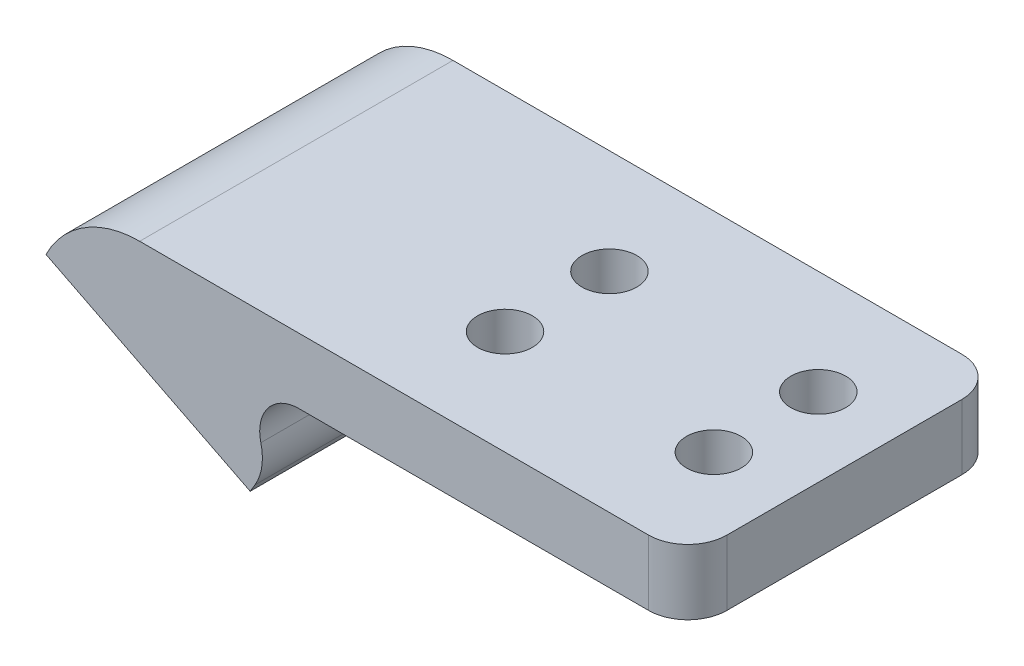
ISO-10303-21;
HEADER;
FILE_DESCRIPTION(('STEP AP214'),'2;1');
FILE_NAME('part.step','',(''),(''),'','','');
FILE_SCHEMA(('AUTOMOTIVE_DESIGN { 1 0 10303 214 1 1 1 1 }'));
ENDSEC;
DATA;
#1=APPLICATION_CONTEXT('core data for automotive mechanical design processes');
#2=APPLICATION_PROTOCOL_DEFINITION('international standard','automotive_design',2000,#1);
#3=PRODUCT_CONTEXT('',#1,'mechanical');
#4=PRODUCT('Part','Part','',(#3));
#5=PRODUCT_RELATED_PRODUCT_CATEGORY('part','',(#4));
#6=PRODUCT_DEFINITION_FORMATION('','',#4);
#7=PRODUCT_DEFINITION_CONTEXT('part definition',#1,'design');
#8=PRODUCT_DEFINITION('design','',#6,#7);
#9=PRODUCT_DEFINITION_SHAPE('','',#8);
#10=(LENGTH_UNIT() NAMED_UNIT(*) SI_UNIT(.MILLI.,.METRE.));
#11=(NAMED_UNIT(*) PLANE_ANGLE_UNIT() SI_UNIT($,.RADIAN.));
#12=(NAMED_UNIT(*) SI_UNIT($,.STERADIAN.) SOLID_ANGLE_UNIT());
#13=UNCERTAINTY_MEASURE_WITH_UNIT(LENGTH_MEASURE(1.E-05),#10,'distance_accuracy_value','');
#14=(GEOMETRIC_REPRESENTATION_CONTEXT(3) GLOBAL_UNCERTAINTY_ASSIGNED_CONTEXT((#13)) GLOBAL_UNIT_ASSIGNED_CONTEXT((#10,
#11,#12)) REPRESENTATION_CONTEXT('',''));
#15=CARTESIAN_POINT('',(0.,0.,0.));
#16=DIRECTION('',(0.,0.,1.));
#17=DIRECTION('',(1.,0.,0.));
#18=AXIS2_PLACEMENT_3D('',#15,#16,#17);
#19=CARTESIAN_POINT('',(-6.55963087060098,0.,24.));
#20=DIRECTION('',(0.,1.,0.));
#21=DIRECTION('',(0.,0.,1.));
#22=AXIS2_PLACEMENT_3D('',#19,#20,#21);
#23=PLANE('',#22);
#24=CARTESIAN_POINT('',(8.44036912939902,0.,8.));
#25=DIRECTION('',(0.,1.,0.));
#26=DIRECTION('',(0.,0.,1.));
#27=AXIS2_PLACEMENT_3D('',#24,#25,#26);
#28=CIRCLE('',#27,2.1);
#29=CARTESIAN_POINT('',(8.44036912939902,0.,10.1));
#30=VERTEX_POINT('',#29);
#31=EDGE_CURVE('E463',#30,#30,#28,.T.);
#32=ORIENTED_EDGE('',*,*,#31,.T.);
#33=EDGE_LOOP('',(#32));
#34=FACE_BOUND('',#33,.T.);
#35=CARTESIAN_POINT('',(24.440369129399,0.,16.));
#36=DIRECTION('',(0.,1.,0.));
#37=DIRECTION('',(0.,0.,1.));
#38=AXIS2_PLACEMENT_3D('',#35,#36,#37);
#39=CIRCLE('',#38,2.1);
#40=CARTESIAN_POINT('',(24.440369129399,0.,18.1));
#41=VERTEX_POINT('',#40);
#42=EDGE_CURVE('E468',#41,#41,#39,.T.);
#43=ORIENTED_EDGE('',*,*,#42,.T.);
#44=EDGE_LOOP('',(#43));
#45=FACE_BOUND('',#44,.T.);
#46=CARTESIAN_POINT('',(24.440369129399,0.,8.));
#47=DIRECTION('',(0.,1.,0.));
#48=DIRECTION('',(0.,0.,1.));
#49=AXIS2_PLACEMENT_3D('',#46,#47,#48);
#50=CIRCLE('',#49,2.1);
#51=CARTESIAN_POINT('',(24.440369129399,0.,10.1));
#52=VERTEX_POINT('',#51);
#53=EDGE_CURVE('E474',#52,#52,#50,.T.);
#54=ORIENTED_EDGE('',*,*,#53,.T.);
#55=EDGE_LOOP('',(#54));
#56=FACE_BOUND('',#55,.T.);
#57=CARTESIAN_POINT('',(8.44036912939902,0.,16.));
#58=DIRECTION('',(0.,1.,0.));
#59=DIRECTION('',(0.,0.,1.));
#60=AXIS2_PLACEMENT_3D('',#57,#58,#59);
#61=CIRCLE('',#60,2.1);
#62=CARTESIAN_POINT('',(8.44036912939902,0.,18.1));
#63=VERTEX_POINT('',#62);
#64=EDGE_CURVE('E480',#63,#63,#61,.T.);
#65=ORIENTED_EDGE('',*,*,#64,.T.);
#66=EDGE_LOOP('',(#65));
#67=FACE_BOUND('',#66,.T.);
#68=DIRECTION('',(1.,0.,0.));
#69=VECTOR('',#68,1.);
#70=CARTESIAN_POINT('',(-6.55963087060098,0.,0.));
#71=LINE('',#70,#69);
#72=CARTESIAN_POINT('',(0.647584166850476,0.,0.));
#73=VERTEX_POINT('',#72);
#74=CARTESIAN_POINT('',(27.440369129399,0.,0.));
#75=VERTEX_POINT('',#74);
#76=EDGE_CURVE('E158',#73,#75,#71,.T.);
#77=ORIENTED_EDGE('',*,*,#76,.T.);
#78=CARTESIAN_POINT('',(27.440369129399,0.,3.));
#79=DIRECTION('',(0.,1.,0.));
#80=DIRECTION('',(0.,0.,1.));
#81=AXIS2_PLACEMENT_3D('',#78,#79,#80);
#82=CIRCLE('',#81,3.);
#83=CARTESIAN_POINT('',(30.440369129399,0.,3.));
#84=VERTEX_POINT('',#83);
#85=EDGE_CURVE('E45',#75,#84,#82,.F.);
#86=ORIENTED_EDGE('',*,*,#85,.T.);
#87=DIRECTION('',(0.,0.,-1.));
#88=VECTOR('',#87,1.);
#89=CARTESIAN_POINT('',(30.440369129399,0.,0.));
#90=LINE('',#89,#88);
#91=CARTESIAN_POINT('',(30.440369129399,0.,21.));
#92=VERTEX_POINT('',#91);
#93=EDGE_CURVE('E151',#92,#84,#90,.T.);
#94=ORIENTED_EDGE('',*,*,#93,.F.);
#95=CARTESIAN_POINT('',(27.440369129399,0.,21.));
#96=DIRECTION('',(0.,1.,0.));
#97=DIRECTION('',(0.,0.,1.));
#98=AXIS2_PLACEMENT_3D('',#95,#96,#97);
#99=CIRCLE('',#98,3.);
#100=CARTESIAN_POINT('',(27.440369129399,0.,24.));
#101=VERTEX_POINT('',#100);
#102=EDGE_CURVE('E52',#92,#101,#99,.F.);
#103=ORIENTED_EDGE('',*,*,#102,.T.);
#104=DIRECTION('',(1.,0.,0.));
#105=VECTOR('',#104,1.);
#106=CARTESIAN_POINT('',(-6.55963087060098,0.,24.));
#107=LINE('',#106,#105);
#108=CARTESIAN_POINT('',(0.647584166850476,0.,24.));
#109=VERTEX_POINT('',#108);
#110=EDGE_CURVE('E160',#109,#101,#107,.T.);
#111=ORIENTED_EDGE('',*,*,#110,.F.);
#112=DIRECTION('',(0.,0.,-1.));
#113=VECTOR('',#112,1.);
#114=CARTESIAN_POINT('',(0.647584166850476,0.,24.));
#115=LINE('',#114,#113);
#116=EDGE_CURVE('E183',#109,#73,#115,.T.);
#117=ORIENTED_EDGE('',*,*,#116,.T.);
#118=EDGE_LOOP('',(#77,#86,#94,#103,#111,#117));
#119=FACE_BOUND('',#118,.T.);
#120=ADVANCED_FACE('F37',(#34,#45,#56,#67,#119),#23,.F.);
#121=CARTESIAN_POINT('',(-6.55963087060098,5.,24.));
#122=DIRECTION('',(0.,-1.,0.));
#123=DIRECTION('',(0.,0.,-1.));
#124=AXIS2_PLACEMENT_3D('',#121,#122,#123);
#125=PLANE('',#124);
#126=CARTESIAN_POINT('',(8.44036912939902,5.,8.));
#127=DIRECTION('',(0.,1.,0.));
#128=DIRECTION('',(0.,0.,1.));
#129=AXIS2_PLACEMENT_3D('',#126,#127,#128);
#130=CIRCLE('',#129,2.1);
#131=CARTESIAN_POINT('',(8.44036912939902,5.,10.1));
#132=VERTEX_POINT('',#131);
#133=EDGE_CURVE('E459',#132,#132,#130,.T.);
#134=ORIENTED_EDGE('',*,*,#133,.F.);
#135=EDGE_LOOP('',(#134));
#136=FACE_BOUND('',#135,.T.);
#137=CARTESIAN_POINT('',(24.440369129399,5.,16.));
#138=DIRECTION('',(0.,1.,0.));
#139=DIRECTION('',(0.,0.,1.));
#140=AXIS2_PLACEMENT_3D('',#137,#138,#139);
#141=CIRCLE('',#140,2.1);
#142=CARTESIAN_POINT('',(24.440369129399,5.,18.1));
#143=VERTEX_POINT('',#142);
#144=EDGE_CURVE('E465',#143,#143,#141,.T.);
#145=ORIENTED_EDGE('',*,*,#144,.F.);
#146=EDGE_LOOP('',(#145));
#147=FACE_BOUND('',#146,.T.);
#148=CARTESIAN_POINT('',(24.440369129399,5.,8.));
#149=DIRECTION('',(0.,1.,0.));
#150=DIRECTION('',(0.,0.,1.));
#151=AXIS2_PLACEMENT_3D('',#148,#149,#150);
#152=CIRCLE('',#151,2.1);
#153=CARTESIAN_POINT('',(24.440369129399,5.,10.1));
#154=VERTEX_POINT('',#153);
#155=EDGE_CURVE('E471',#154,#154,#152,.T.);
#156=ORIENTED_EDGE('',*,*,#155,.F.);
#157=EDGE_LOOP('',(#156));
#158=FACE_BOUND('',#157,.T.);
#159=CARTESIAN_POINT('',(8.44036912939902,5.,16.));
#160=DIRECTION('',(0.,1.,0.));
#161=DIRECTION('',(0.,0.,1.));
#162=AXIS2_PLACEMENT_3D('',#159,#160,#161);
#163=CIRCLE('',#162,2.1);
#164=CARTESIAN_POINT('',(8.44036912939902,5.,18.1));
#165=VERTEX_POINT('',#164);
#166=EDGE_CURVE('E477',#165,#165,#163,.T.);
#167=ORIENTED_EDGE('',*,*,#166,.F.);
#168=EDGE_LOOP('',(#167));
#169=FACE_BOUND('',#168,.T.);
#170=DIRECTION('',(0.,0.,1.));
#171=VECTOR('',#170,1.);
#172=CARTESIAN_POINT('',(30.440369129399,5.,0.));
#173=LINE('',#172,#171);
#174=CARTESIAN_POINT('',(30.440369129399,5.,3.));
#175=VERTEX_POINT('',#174);
#176=CARTESIAN_POINT('',(30.440369129399,5.,21.));
#177=VERTEX_POINT('',#176);
#178=EDGE_CURVE('E212',#175,#177,#173,.T.);
#179=ORIENTED_EDGE('',*,*,#178,.F.);
#180=CARTESIAN_POINT('',(27.440369129399,5.,3.));
#181=DIRECTION('',(0.,-1.,0.));
#182=DIRECTION('',(0.,0.,-1.));
#183=AXIS2_PLACEMENT_3D('',#180,#181,#182);
#184=CIRCLE('',#183,3.);
#185=CARTESIAN_POINT('',(27.440369129399,5.,0.));
#186=VERTEX_POINT('',#185);
#187=EDGE_CURVE('E200',#175,#186,#184,.F.);
#188=ORIENTED_EDGE('',*,*,#187,.T.);
#189=DIRECTION('',(-1.,0.,0.));
#190=VECTOR('',#189,1.);
#191=CARTESIAN_POINT('',(-6.55963087060098,5.,0.));
#192=LINE('',#191,#190);
#193=CARTESIAN_POINT('',(-11.5464888620744,5.,0.));
#194=VERTEX_POINT('',#193);
#195=EDGE_CURVE('E163',#186,#194,#192,.T.);
#196=ORIENTED_EDGE('',*,*,#195,.T.);
#197=DIRECTION('',(0.,0.,1.));
#198=VECTOR('',#197,1.);
#199=CARTESIAN_POINT('',(-11.5464888620744,5.,24.));
#200=LINE('',#199,#198);
#201=CARTESIAN_POINT('',(-11.5464888620744,5.,24.));
#202=VERTEX_POINT('',#201);
#203=EDGE_CURVE('E173',#194,#202,#200,.T.);
#204=ORIENTED_EDGE('',*,*,#203,.T.);
#205=DIRECTION('',(-1.,0.,0.));
#206=VECTOR('',#205,1.);
#207=CARTESIAN_POINT('',(-6.55963087060098,5.,24.));
#208=LINE('',#207,#206);
#209=CARTESIAN_POINT('',(27.440369129399,5.,24.));
#210=VERTEX_POINT('',#209);
#211=EDGE_CURVE('E162',#210,#202,#208,.T.);
#212=ORIENTED_EDGE('',*,*,#211,.F.);
#213=CARTESIAN_POINT('',(27.440369129399,5.,21.));
#214=DIRECTION('',(0.,-1.,0.));
#215=DIRECTION('',(0.,0.,-1.));
#216=AXIS2_PLACEMENT_3D('',#213,#214,#215);
#217=CIRCLE('',#216,3.);
#218=EDGE_CURVE('E198',#210,#177,#217,.F.);
#219=ORIENTED_EDGE('',*,*,#218,.T.);
#220=EDGE_LOOP('',(#179,#188,#196,#204,#212,#219));
#221=FACE_BOUND('',#220,.T.);
#222=ADVANCED_FACE('F215',(#136,#147,#158,#169,#221),#125,.F.);
#223=CARTESIAN_POINT('',(0.,0.,24.));
#224=DIRECTION('',(0.,0.,-1.));
#225=DIRECTION('',(-1.,0.,0.));
#226=AXIS2_PLACEMENT_3D('',#223,#224,#225);
#227=PLANE('',#226);
#228=ORIENTED_EDGE('',*,*,#110,.T.);
#229=DIRECTION('',(0.,-1.,0.));
#230=VECTOR('',#229,1.);
#231=CARTESIAN_POINT('',(27.440369129399,5.,24.));
#232=LINE('',#231,#230);
#233=EDGE_CURVE('E11',#101,#210,#232,.F.);
#234=ORIENTED_EDGE('',*,*,#233,.T.);
#235=ORIENTED_EDGE('',*,*,#211,.T.);
#236=CARTESIAN_POINT('',(-11.5464888620744,-3.,24.));
#237=DIRECTION('',(0.,0.,-1.));
#238=DIRECTION('',(-1.,0.,0.));
#239=AXIS2_PLACEMENT_3D('',#236,#237,#238);
#240=CIRCLE('',#239,8.);
#241=CARTESIAN_POINT('',(-18.6890949535261,0.603217759497323,24.));
#242=VERTEX_POINT('',#241);
#243=EDGE_CURVE('E176',#202,#242,#240,.F.);
#244=ORIENTED_EDGE('',*,*,#243,.T.);
#245=DIRECTION('',(-0.450402219937165,-0.892825761431464,0.));
#246=VECTOR('',#245,1.);
#247=CARTESIAN_POINT('',(-15.1403571708354,7.63782898631034,24.));
#248=LINE('',#247,#246);
#249=CARTESIAN_POINT('',(-18.7230691559257,0.535871192842679,24.));
#250=VERTEX_POINT('',#249);
#251=EDGE_CURVE('E147',#242,#250,#248,.T.);
#252=ORIENTED_EDGE('',*,*,#251,.T.);
#253=DIRECTION('',(0.892825761431464,-0.450402219937165,0.));
#254=VECTOR('',#253,1.);
#255=CARTESIAN_POINT('',(-3.5827119850903,-7.10195779346765,24.));
#256=LINE('',#255,#254);
#257=CARTESIAN_POINT('',(-3.08050844509965,-7.35530351784442,24.));
#258=VERTEX_POINT('',#257);
#259=EDGE_CURVE('E155',#250,#258,#256,.T.);
#260=ORIENTED_EDGE('',*,*,#259,.T.);
#261=DIRECTION('',(0.514410733953749,0.857543932864763,0.));
#262=VECTOR('',#261,1.);
#263=CARTESIAN_POINT('',(0.979294379178216,-0.587444585686658,24.));
#264=LINE('',#263,#262);
#265=CARTESIAN_POINT('',(-2.71541169396758,-6.74667215932753,24.));
#266=VERTEX_POINT('',#265);
#267=EDGE_CURVE('E129',#258,#266,#264,.T.);
#268=ORIENTED_EDGE('',*,*,#267,.T.);
#269=CARTESIAN_POINT('',(-6.14558742542663,-4.68902922351253,24.));
#270=DIRECTION('',(0.,0.,-1.));
#271=DIRECTION('',(-1.,0.,0.));
#272=AXIS2_PLACEMENT_3D('',#269,#270,#271);
#273=CIRCLE('',#272,4.);
#274=CARTESIAN_POINT('',(-2.26377508698257,-3.72386966721965,24.));
#275=VERTEX_POINT('',#274);
#276=EDGE_CURVE('E169',#266,#275,#273,.F.);
#277=ORIENTED_EDGE('',*,*,#276,.T.);
#278=CARTESIAN_POINT('',(0.647584166850476,-3.,24.));
#279=DIRECTION('',(0.,0.,-1.));
#280=DIRECTION('',(-1.,0.,0.));
#281=AXIS2_PLACEMENT_3D('',#278,#279,#280);
#282=CIRCLE('',#281,3.);
#283=EDGE_CURVE('E190',#275,#109,#282,.T.);
#284=ORIENTED_EDGE('',*,*,#283,.T.);
#285=EDGE_LOOP('',(#228,#234,#235,#244,#252,#260,#268,#277,#284));
#286=FACE_BOUND('',#285,.T.);
#287=ADVANCED_FACE('F227',(#286),#227,.F.);
#288=CARTESIAN_POINT('',(0.,0.,0.));
#289=DIRECTION('',(0.,0.,-1.));
#290=DIRECTION('',(-1.,0.,0.));
#291=AXIS2_PLACEMENT_3D('',#288,#289,#290);
#292=PLANE('',#291);
#293=ORIENTED_EDGE('',*,*,#195,.F.);
#294=DIRECTION('',(0.,1.,0.));
#295=VECTOR('',#294,1.);
#296=CARTESIAN_POINT('',(27.440369129399,0.,0.));
#297=LINE('',#296,#295);
#298=EDGE_CURVE('E60',#186,#75,#297,.F.);
#299=ORIENTED_EDGE('',*,*,#298,.T.);
#300=ORIENTED_EDGE('',*,*,#76,.F.);
#301=CARTESIAN_POINT('',(0.647584166850476,-3.,0.));
#302=DIRECTION('',(0.,0.,-1.));
#303=DIRECTION('',(-1.,0.,0.));
#304=AXIS2_PLACEMENT_3D('',#301,#302,#303);
#305=CIRCLE('',#304,3.);
#306=CARTESIAN_POINT('',(-2.26377508698257,-3.72386966721965,0.));
#307=VERTEX_POINT('',#306);
#308=EDGE_CURVE('E188',#73,#307,#305,.F.);
#309=ORIENTED_EDGE('',*,*,#308,.T.);
#310=CARTESIAN_POINT('',(-6.14558742542663,-4.68902922351253,0.));
#311=DIRECTION('',(0.,0.,-1.));
#312=DIRECTION('',(-1.,0.,0.));
#313=AXIS2_PLACEMENT_3D('',#310,#311,#312);
#314=CIRCLE('',#313,4.);
#315=CARTESIAN_POINT('',(-2.71541169396758,-6.74667215932753,0.));
#316=VERTEX_POINT('',#315);
#317=EDGE_CURVE('E142',#307,#316,#314,.T.);
#318=ORIENTED_EDGE('',*,*,#317,.T.);
#319=DIRECTION('',(0.514410733953749,0.857543932864763,0.));
#320=VECTOR('',#319,1.);
#321=CARTESIAN_POINT('',(0.979294379178216,-0.587444585686658,0.));
#322=LINE('',#321,#320);
#323=CARTESIAN_POINT('',(-3.08050844509965,-7.35530351784442,0.));
#324=VERTEX_POINT('',#323);
#325=EDGE_CURVE('E126',#324,#316,#322,.T.);
#326=ORIENTED_EDGE('',*,*,#325,.F.);
#327=DIRECTION('',(0.892825761431464,-0.450402219937165,0.));
#328=VECTOR('',#327,1.);
#329=CARTESIAN_POINT('',(-3.5827119850903,-7.10195779346765,0.));
#330=LINE('',#329,#328);
#331=CARTESIAN_POINT('',(-18.7230691559257,0.535871192842679,0.));
#332=VERTEX_POINT('',#331);
#333=EDGE_CURVE('E140',#332,#324,#330,.T.);
#334=ORIENTED_EDGE('',*,*,#333,.F.);
#335=DIRECTION('',(-0.450402219937165,-0.892825761431464,0.));
#336=VECTOR('',#335,1.);
#337=CARTESIAN_POINT('',(-15.1403571708354,7.63782898631034,0.));
#338=LINE('',#337,#336);
#339=CARTESIAN_POINT('',(-18.6890949535261,0.603217759497323,0.));
#340=VERTEX_POINT('',#339);
#341=EDGE_CURVE('E135',#340,#332,#338,.T.);
#342=ORIENTED_EDGE('',*,*,#341,.F.);
#343=CARTESIAN_POINT('',(-11.5464888620744,-3.,0.));
#344=DIRECTION('',(0.,0.,-1.));
#345=DIRECTION('',(-1.,0.,0.));
#346=AXIS2_PLACEMENT_3D('',#343,#344,#345);
#347=CIRCLE('',#346,8.);
#348=EDGE_CURVE('E180',#340,#194,#347,.T.);
#349=ORIENTED_EDGE('',*,*,#348,.T.);
#350=EDGE_LOOP('',(#293,#299,#300,#309,#318,#326,#334,#342,#349));
#351=FACE_BOUND('',#350,.T.);
#352=ADVANCED_FACE('F138',(#351),#292,.T.);
#353=CARTESIAN_POINT('',(-3.5827119850903,-7.10195779346765,0.));
#354=DIRECTION('',(-0.450402219937165,-0.892825761431464,0.));
#355=DIRECTION('',(0.892825761431464,-0.450402219937165,0.));
#356=AXIS2_PLACEMENT_3D('',#353,#354,#355);
#357=PLANE('',#356);
#358=CARTESIAN_POINT('',(-7.37512704285838,-5.18880493125267,8.05));
#359=DIRECTION('',(-0.450402219937165,-0.892825761431464,0.));
#360=DIRECTION('',(0.892825761431464,-0.450402219937165,0.));
#361=AXIS2_PLACEMENT_3D('',#358,#359,#360);
#362=CIRCLE('',#361,2.25);
#363=CARTESIAN_POINT('',(-5.36626907963759,-6.20220992611129,8.05));
#364=VERTEX_POINT('',#363);
#365=EDGE_CURVE('E439',#364,#364,#362,.T.);
#366=ORIENTED_EDGE('',*,*,#365,.F.);
#367=EDGE_LOOP('',(#366));
#368=FACE_BOUND('',#367,.T.);
#369=CARTESIAN_POINT('',(-7.37512704285838,-5.18880493125267,15.95));
#370=DIRECTION('',(-0.450402219937165,-0.892825761431464,0.));
#371=DIRECTION('',(0.892825761431464,-0.450402219937165,0.));
#372=AXIS2_PLACEMENT_3D('',#369,#370,#371);
#373=CIRCLE('',#372,2.25);
#374=CARTESIAN_POINT('',(-5.36626907963759,-6.20220992611129,15.95));
#375=VERTEX_POINT('',#374);
#376=EDGE_CURVE('E438',#375,#375,#373,.T.);
#377=ORIENTED_EDGE('',*,*,#376,.F.);
#378=EDGE_LOOP('',(#377));
#379=FACE_BOUND('',#378,.T.);
#380=CARTESIAN_POINT('',(-14.4284505581669,-1.63062739374907,15.95));
#381=DIRECTION('',(-0.450402219937165,-0.892825761431464,0.));
#382=DIRECTION('',(0.892825761431464,-0.450402219937165,0.));
#383=AXIS2_PLACEMENT_3D('',#380,#381,#382);
#384=CIRCLE('',#383,2.25);
#385=CARTESIAN_POINT('',(-12.4195925949462,-2.64403238860769,15.95));
#386=VERTEX_POINT('',#385);
#387=EDGE_CURVE('E448',#386,#386,#384,.T.);
#388=ORIENTED_EDGE('',*,*,#387,.F.);
#389=EDGE_LOOP('',(#388));
#390=FACE_BOUND('',#389,.T.);
#391=CARTESIAN_POINT('',(-14.4284505581669,-1.63062739374907,8.05));
#392=DIRECTION('',(-0.450402219937165,-0.892825761431464,0.));
#393=DIRECTION('',(0.892825761431464,-0.450402219937165,0.));
#394=AXIS2_PLACEMENT_3D('',#391,#392,#393);
#395=CIRCLE('',#394,2.25);
#396=CARTESIAN_POINT('',(-12.4195925949462,-2.64403238860769,8.05));
#397=VERTEX_POINT('',#396);
#398=EDGE_CURVE('E453',#397,#397,#395,.T.);
#399=ORIENTED_EDGE('',*,*,#398,.F.);
#400=EDGE_LOOP('',(#399));
#401=FACE_BOUND('',#400,.T.);
#402=ORIENTED_EDGE('',*,*,#259,.F.);
#403=DIRECTION('',(0.,0.,1.));
#404=VECTOR('',#403,1.);
#405=CARTESIAN_POINT('',(-18.7230691559257,0.535871192842679,0.));
#406=LINE('',#405,#404);
#407=EDGE_CURVE('E134',#332,#250,#406,.T.);
#408=ORIENTED_EDGE('',*,*,#407,.F.);
#409=ORIENTED_EDGE('',*,*,#333,.T.);
#410=DIRECTION('',(0.,0.,1.));
#411=VECTOR('',#410,1.);
#412=CARTESIAN_POINT('',(-3.08050844509965,-7.35530351784442,0.));
#413=LINE('',#412,#411);
#414=EDGE_CURVE('E122',#324,#258,#413,.T.);
#415=ORIENTED_EDGE('',*,*,#414,.T.);
#416=EDGE_LOOP('',(#402,#408,#409,#415));
#417=FACE_BOUND('',#416,.T.);
#418=ADVANCED_FACE('F145',(#368,#379,#390,#401,#417),#357,.T.);
#419=CARTESIAN_POINT('',(-15.1403571708354,7.63782898631034,0.));
#420=DIRECTION('',(-0.892825761431464,0.450402219937165,0.));
#421=DIRECTION('',(-0.450402219937165,-0.892825761431464,0.));
#422=AXIS2_PLACEMENT_3D('',#419,#420,#421);
#423=PLANE('',#422);
#424=ORIENTED_EDGE('',*,*,#251,.F.);
#425=DIRECTION('',(0.,0.,1.));
#426=VECTOR('',#425,1.);
#427=CARTESIAN_POINT('',(-18.6890949535261,0.603217759497324,0.));
#428=LINE('',#427,#426);
#429=EDGE_CURVE('E178',#242,#340,#428,.F.);
#430=ORIENTED_EDGE('',*,*,#429,.T.);
#431=ORIENTED_EDGE('',*,*,#341,.T.);
#432=ORIENTED_EDGE('',*,*,#407,.T.);
#433=EDGE_LOOP('',(#424,#430,#431,#432));
#434=FACE_BOUND('',#433,.T.);
#435=ADVANCED_FACE('F237',(#434),#423,.T.);
#436=CARTESIAN_POINT('',(0.979294379178216,-0.587444585686658,0.));
#437=DIRECTION('',(0.857543932864763,-0.514410733953749,0.));
#438=DIRECTION('',(0.514410733953749,0.857543932864763,0.));
#439=AXIS2_PLACEMENT_3D('',#436,#437,#438);
#440=PLANE('',#439);
#441=ORIENTED_EDGE('',*,*,#325,.T.);
#442=DIRECTION('',(0.,0.,1.));
#443=VECTOR('',#442,1.);
#444=CARTESIAN_POINT('',(-2.71541169396758,-6.74667215932753,24.));
#445=LINE('',#444,#443);
#446=EDGE_CURVE('E165',#316,#266,#445,.T.);
#447=ORIENTED_EDGE('',*,*,#446,.T.);
#448=ORIENTED_EDGE('',*,*,#267,.F.);
#449=ORIENTED_EDGE('',*,*,#414,.F.);
#450=EDGE_LOOP('',(#441,#447,#448,#449));
#451=FACE_BOUND('',#450,.T.);
#452=ADVANCED_FACE('F124',(#451),#440,.T.);
#453=CARTESIAN_POINT('',(-6.14558742542663,-4.68902922351253,0.));
#454=DIRECTION('',(0.,0.,-1.));
#455=DIRECTION('',(-1.,0.,0.));
#456=AXIS2_PLACEMENT_3D('',#453,#454,#455);
#457=CYLINDRICAL_SURFACE('',#456,4.);
#458=ORIENTED_EDGE('',*,*,#317,.F.);
#459=DIRECTION('',(0.,0.,-1.));
#460=VECTOR('',#459,1.);
#461=CARTESIAN_POINT('',(-2.26377508698257,-3.72386966721965,0.));
#462=LINE('',#461,#460);
#463=EDGE_CURVE('E186',#307,#275,#462,.F.);
#464=ORIENTED_EDGE('',*,*,#463,.T.);
#465=ORIENTED_EDGE('',*,*,#276,.F.);
#466=ORIENTED_EDGE('',*,*,#446,.F.);
#467=EDGE_LOOP('',(#458,#464,#465,#466));
#468=FACE_BOUND('',#467,.T.);
#469=ADVANCED_FACE('F234',(#468),#457,.T.);
#470=CARTESIAN_POINT('',(-11.5464888620744,-3.,24.));
#471=DIRECTION('',(0.,0.,-1.));
#472=DIRECTION('',(-1.,0.,0.));
#473=AXIS2_PLACEMENT_3D('',#470,#471,#472);
#474=CYLINDRICAL_SURFACE('',#473,8.);
#475=ORIENTED_EDGE('',*,*,#348,.F.);
#476=ORIENTED_EDGE('',*,*,#429,.F.);
#477=ORIENTED_EDGE('',*,*,#243,.F.);
#478=ORIENTED_EDGE('',*,*,#203,.F.);
#479=EDGE_LOOP('',(#475,#476,#477,#478));
#480=FACE_BOUND('',#479,.T.);
#481=ADVANCED_FACE('F221',(#480),#474,.T.);
#482=CARTESIAN_POINT('',(0.647584166850476,-3.,0.));
#483=DIRECTION('',(0.,0.,-1.));
#484=DIRECTION('',(-1.,0.,0.));
#485=AXIS2_PLACEMENT_3D('',#482,#483,#484);
#486=CYLINDRICAL_SURFACE('',#485,3.);
#487=ORIENTED_EDGE('',*,*,#283,.F.);
#488=ORIENTED_EDGE('',*,*,#463,.F.);
#489=ORIENTED_EDGE('',*,*,#308,.F.);
#490=ORIENTED_EDGE('',*,*,#116,.F.);
#491=EDGE_LOOP('',(#487,#488,#489,#490));
#492=FACE_BOUND('',#491,.T.);
#493=ADVANCED_FACE('F231',(#492),#486,.F.);
#494=CARTESIAN_POINT('',(30.440369129399,0.,0.));
#495=DIRECTION('',(1.,0.,0.));
#496=DIRECTION('',(0.,0.,-1.));
#497=AXIS2_PLACEMENT_3D('',#494,#495,#496);
#498=PLANE('',#497);
#499=ORIENTED_EDGE('',*,*,#93,.T.);
#500=DIRECTION('',(0.,1.,0.));
#501=VECTOR('',#500,1.);
#502=CARTESIAN_POINT('',(30.440369129399,0.,3.));
#503=LINE('',#502,#501);
#504=EDGE_CURVE('E195',#84,#175,#503,.T.);
#505=ORIENTED_EDGE('',*,*,#504,.T.);
#506=ORIENTED_EDGE('',*,*,#178,.T.);
#507=DIRECTION('',(0.,-1.,0.));
#508=VECTOR('',#507,1.);
#509=CARTESIAN_POINT('',(30.440369129399,0.,21.));
#510=LINE('',#509,#508);
#511=EDGE_CURVE('E192',#177,#92,#510,.T.);
#512=ORIENTED_EDGE('',*,*,#511,.T.);
#513=EDGE_LOOP('',(#499,#505,#506,#512));
#514=FACE_BOUND('',#513,.T.);
#515=ADVANCED_FACE('F208',(#514),#498,.T.);
#516=CARTESIAN_POINT('',(8.44036912939902,-5.,16.));
#517=DIRECTION('',(0.,1.,0.));
#518=DIRECTION('',(0.,0.,1.));
#519=AXIS2_PLACEMENT_3D('',#516,#517,#518);
#520=CYLINDRICAL_SURFACE('',#519,2.1);
#521=ORIENTED_EDGE('',*,*,#166,.T.);
#522=EDGE_LOOP('',(#521));
#523=FACE_BOUND('',#522,.T.);
#524=ORIENTED_EDGE('',*,*,#64,.F.);
#525=EDGE_LOOP('',(#524));
#526=FACE_BOUND('',#525,.T.);
#527=ADVANCED_FACE('F288',(#523,#526),#520,.F.);
#528=CARTESIAN_POINT('',(24.440369129399,-5.,8.));
#529=DIRECTION('',(0.,1.,0.));
#530=DIRECTION('',(0.,0.,1.));
#531=AXIS2_PLACEMENT_3D('',#528,#529,#530);
#532=CYLINDRICAL_SURFACE('',#531,2.1);
#533=ORIENTED_EDGE('',*,*,#155,.T.);
#534=EDGE_LOOP('',(#533));
#535=FACE_BOUND('',#534,.T.);
#536=ORIENTED_EDGE('',*,*,#53,.F.);
#537=EDGE_LOOP('',(#536));
#538=FACE_BOUND('',#537,.T.);
#539=ADVANCED_FACE('F278',(#535,#538),#532,.F.);
#540=CARTESIAN_POINT('',(24.440369129399,-5.,16.));
#541=DIRECTION('',(0.,1.,0.));
#542=DIRECTION('',(0.,0.,1.));
#543=AXIS2_PLACEMENT_3D('',#540,#541,#542);
#544=CYLINDRICAL_SURFACE('',#543,2.1);
#545=ORIENTED_EDGE('',*,*,#144,.T.);
#546=EDGE_LOOP('',(#545));
#547=FACE_BOUND('',#546,.T.);
#548=ORIENTED_EDGE('',*,*,#42,.F.);
#549=EDGE_LOOP('',(#548));
#550=FACE_BOUND('',#549,.T.);
#551=ADVANCED_FACE('F272',(#547,#550),#544,.F.);
#552=CARTESIAN_POINT('',(8.44036912939902,-5.,8.));
#553=DIRECTION('',(0.,1.,0.));
#554=DIRECTION('',(0.,0.,1.));
#555=AXIS2_PLACEMENT_3D('',#552,#553,#554);
#556=CYLINDRICAL_SURFACE('',#555,2.1);
#557=ORIENTED_EDGE('',*,*,#133,.T.);
#558=EDGE_LOOP('',(#557));
#559=FACE_BOUND('',#558,.T.);
#560=ORIENTED_EDGE('',*,*,#31,.F.);
#561=EDGE_LOOP('',(#560));
#562=FACE_BOUND('',#561,.T.);
#563=ADVANCED_FACE('F266',(#559,#562),#556,.F.);
#564=CARTESIAN_POINT('',(27.440369129399,0.,3.));
#565=DIRECTION('',(0.,1.,0.));
#566=DIRECTION('',(0.,0.,1.));
#567=AXIS2_PLACEMENT_3D('',#564,#565,#566);
#568=CYLINDRICAL_SURFACE('',#567,3.);
#569=ORIENTED_EDGE('',*,*,#85,.F.);
#570=ORIENTED_EDGE('',*,*,#298,.F.);
#571=ORIENTED_EDGE('',*,*,#187,.F.);
#572=ORIENTED_EDGE('',*,*,#504,.F.);
#573=EDGE_LOOP('',(#569,#570,#571,#572));
#574=FACE_BOUND('',#573,.T.);
#575=ADVANCED_FACE('F213',(#574),#568,.T.);
#576=CARTESIAN_POINT('',(27.440369129399,0.,21.));
#577=DIRECTION('',(0.,1.,0.));
#578=DIRECTION('',(0.,0.,1.));
#579=AXIS2_PLACEMENT_3D('',#576,#577,#578);
#580=CYLINDRICAL_SURFACE('',#579,3.);
#581=ORIENTED_EDGE('',*,*,#218,.F.);
#582=ORIENTED_EDGE('',*,*,#233,.F.);
#583=ORIENTED_EDGE('',*,*,#102,.F.);
#584=ORIENTED_EDGE('',*,*,#511,.F.);
#585=EDGE_LOOP('',(#581,#582,#583,#584));
#586=FACE_BOUND('',#585,.T.);
#587=ADVANCED_FACE('F39',(#586),#580,.T.);
#588=CARTESIAN_POINT('',(-12.6268416784183,1.94067565197679,8.05));
#589=DIRECTION('',(-0.450402219937165,-0.892825761431464,0.));
#590=DIRECTION('',(0.892825761431464,-0.450402219937165,0.));
#591=AXIS2_PLACEMENT_3D('',#588,#589,#590);
#592=CYLINDRICAL_SURFACE('',#591,2.25);
#593=CARTESIAN_POINT('',(-12.6268416784183,1.94067565197679,8.05));
#594=DIRECTION('',(-0.450402219937165,-0.892825761431464,0.));
#595=DIRECTION('',(0.892825761431464,-0.450402219937165,0.));
#596=AXIS2_PLACEMENT_3D('',#593,#594,#595);
#597=CIRCLE('',#596,2.25);
#598=CARTESIAN_POINT('',(-10.6179837151975,0.927270657118167,8.05));
#599=VERTEX_POINT('',#598);
#600=EDGE_CURVE('E456',#599,#599,#597,.T.);
#601=ORIENTED_EDGE('',*,*,#600,.F.);
#602=EDGE_LOOP('',(#601));
#603=FACE_BOUND('',#602,.T.);
#604=ORIENTED_EDGE('',*,*,#398,.T.);
#605=EDGE_LOOP('',(#604));
#606=FACE_BOUND('',#605,.T.);
#607=ADVANCED_FACE('F271',(#603,#606),#592,.F.);
#608=CARTESIAN_POINT('',(-12.6268416784183,1.94067565197679,8.05));
#609=DIRECTION('',(-0.450402219937165,-0.892825761431464,0.));
#610=DIRECTION('',(0.892825761431464,-0.450402219937165,0.));
#611=AXIS2_PLACEMENT_3D('',#608,#609,#610);
#612=PLANE('',#611);
#613=ORIENTED_EDGE('',*,*,#600,.T.);
#614=EDGE_LOOP('',(#613));
#615=FACE_BOUND('',#614,.T.);
#616=ADVANCED_FACE('F363',(#615),#612,.T.);
#617=CARTESIAN_POINT('',(-12.6268416784183,1.94067565197679,15.95));
#618=DIRECTION('',(-0.450402219937165,-0.892825761431464,0.));
#619=DIRECTION('',(0.892825761431464,-0.450402219937165,0.));
#620=AXIS2_PLACEMENT_3D('',#617,#618,#619);
#621=CYLINDRICAL_SURFACE('',#620,2.25);
#622=CARTESIAN_POINT('',(-12.6268416784183,1.94067565197679,15.95));
#623=DIRECTION('',(-0.450402219937165,-0.892825761431464,0.));
#624=DIRECTION('',(0.892825761431464,-0.450402219937165,0.));
#625=AXIS2_PLACEMENT_3D('',#622,#623,#624);
#626=CIRCLE('',#625,2.25);
#627=CARTESIAN_POINT('',(-10.6179837151975,0.927270657118167,15.95));
#628=VERTEX_POINT('',#627);
#629=EDGE_CURVE('E450',#628,#628,#626,.T.);
#630=ORIENTED_EDGE('',*,*,#629,.F.);
#631=EDGE_LOOP('',(#630));
#632=FACE_BOUND('',#631,.T.);
#633=ORIENTED_EDGE('',*,*,#387,.T.);
#634=EDGE_LOOP('',(#633));
#635=FACE_BOUND('',#634,.T.);
#636=ADVANCED_FACE('F372',(#632,#635),#621,.F.);
#637=CARTESIAN_POINT('',(-12.6268416784183,1.94067565197679,15.95));
#638=DIRECTION('',(-0.450402219937165,-0.892825761431464,0.));
#639=DIRECTION('',(0.892825761431464,-0.450402219937165,0.));
#640=AXIS2_PLACEMENT_3D('',#637,#638,#639);
#641=PLANE('',#640);
#642=ORIENTED_EDGE('',*,*,#629,.T.);
#643=EDGE_LOOP('',(#642));
#644=FACE_BOUND('',#643,.T.);
#645=ADVANCED_FACE('F381',(#644),#641,.T.);
#646=CARTESIAN_POINT('',(-5.57351816310972,-1.61750188552682,15.95));
#647=DIRECTION('',(-0.450402219937165,-0.892825761431464,0.));
#648=DIRECTION('',(0.892825761431464,-0.450402219937165,0.));
#649=AXIS2_PLACEMENT_3D('',#646,#647,#648);
#650=CYLINDRICAL_SURFACE('',#649,2.25);
#651=CARTESIAN_POINT('',(-5.57351816310972,-1.61750188552682,15.95));
#652=DIRECTION('',(-0.450402219937165,-0.892825761431464,0.));
#653=DIRECTION('',(0.892825761431464,-0.450402219937165,0.));
#654=AXIS2_PLACEMENT_3D('',#651,#652,#653);
#655=CIRCLE('',#654,2.25);
#656=CARTESIAN_POINT('',(-3.56466019988893,-2.63090688038544,15.95));
#657=VERTEX_POINT('',#656);
#658=EDGE_CURVE('E442',#657,#657,#655,.T.);
#659=ORIENTED_EDGE('',*,*,#658,.F.);
#660=EDGE_LOOP('',(#659));
#661=FACE_BOUND('',#660,.T.);
#662=ORIENTED_EDGE('',*,*,#376,.T.);
#663=EDGE_LOOP('',(#662));
#664=FACE_BOUND('',#663,.T.);
#665=ADVANCED_FACE('F391',(#661,#664),#650,.F.);
#666=CARTESIAN_POINT('',(-5.57351816310972,-1.61750188552682,15.95));
#667=DIRECTION('',(-0.450402219937165,-0.892825761431464,0.));
#668=DIRECTION('',(0.892825761431464,-0.450402219937165,0.));
#669=AXIS2_PLACEMENT_3D('',#666,#667,#668);
#670=PLANE('',#669);
#671=ORIENTED_EDGE('',*,*,#658,.T.);
#672=EDGE_LOOP('',(#671));
#673=FACE_BOUND('',#672,.T.);
#674=ADVANCED_FACE('F401',(#673),#670,.T.);
#675=CARTESIAN_POINT('',(-5.57351816310972,-1.61750188552682,8.05));
#676=DIRECTION('',(-0.450402219937165,-0.892825761431464,0.));
#677=DIRECTION('',(0.892825761431464,-0.450402219937165,0.));
#678=AXIS2_PLACEMENT_3D('',#675,#676,#677);
#679=CYLINDRICAL_SURFACE('',#678,2.25);
#680=CARTESIAN_POINT('',(-5.57351816310972,-1.61750188552682,8.05));
#681=DIRECTION('',(-0.450402219937165,-0.892825761431464,0.));
#682=DIRECTION('',(0.892825761431464,-0.450402219937165,0.));
#683=AXIS2_PLACEMENT_3D('',#680,#681,#682);
#684=CIRCLE('',#683,2.25);
#685=CARTESIAN_POINT('',(-3.56466019988893,-2.63090688038544,8.05));
#686=VERTEX_POINT('',#685);
#687=EDGE_CURVE('E437',#686,#686,#684,.T.);
#688=ORIENTED_EDGE('',*,*,#687,.F.);
#689=EDGE_LOOP('',(#688));
#690=FACE_BOUND('',#689,.T.);
#691=ORIENTED_EDGE('',*,*,#365,.T.);
#692=EDGE_LOOP('',(#691));
#693=FACE_BOUND('',#692,.T.);
#694=ADVANCED_FACE('F411',(#690,#693),#679,.F.);
#695=CARTESIAN_POINT('',(-5.57351816310972,-1.61750188552682,8.05));
#696=DIRECTION('',(-0.450402219937165,-0.892825761431464,0.));
#697=DIRECTION('',(0.892825761431464,-0.450402219937165,0.));
#698=AXIS2_PLACEMENT_3D('',#695,#696,#697);
#699=PLANE('',#698);
#700=ORIENTED_EDGE('',*,*,#687,.T.);
#701=EDGE_LOOP('',(#700));
#702=FACE_BOUND('',#701,.T.);
#703=ADVANCED_FACE('F421',(#702),#699,.T.);
#704=CLOSED_SHELL('',(#120,#222,#287,#352,#418,#435,#452,#469,#481,#493,#515,#527,#539,#551,
#563,#575,#587,#607,#616,#636,#645,#665,#674,#694,#703));
#705=MANIFOLD_SOLID_BREP('B2',#704);
#706=ADVANCED_BREP_SHAPE_REPRESENTATION('',(#18,#705),#14);
#707=SHAPE_DEFINITION_REPRESENTATION(#9,#706);
ENDSEC;
END-ISO-10303-21;
